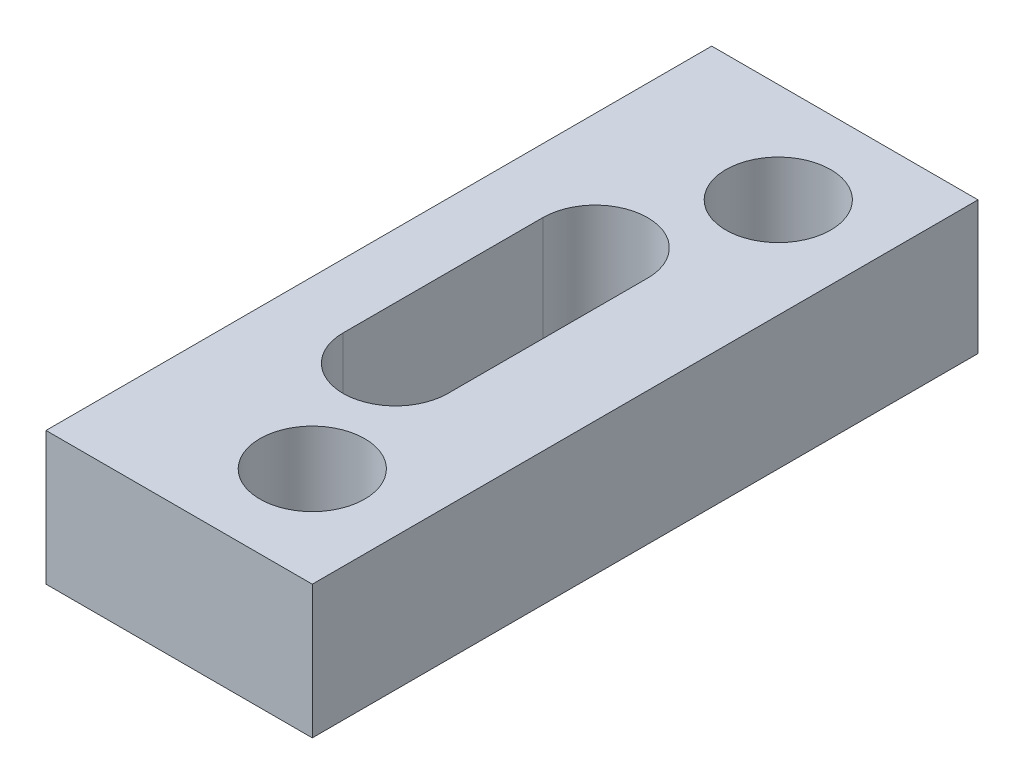
ISO-10303-21;
HEADER;
FILE_DESCRIPTION(('STEP AP214'),'2;1');
FILE_NAME('part.step','',(''),(''),'','','');
FILE_SCHEMA(('AUTOMOTIVE_DESIGN { 1 0 10303 214 1 1 1 1 }'));
ENDSEC;
DATA;
#1=APPLICATION_CONTEXT('core data for automotive mechanical design processes');
#2=APPLICATION_PROTOCOL_DEFINITION('international standard','automotive_design',2000,#1);
#3=PRODUCT_CONTEXT('',#1,'mechanical');
#4=PRODUCT('Part','Part','',(#3));
#5=PRODUCT_RELATED_PRODUCT_CATEGORY('part','',(#4));
#6=PRODUCT_DEFINITION_FORMATION('','',#4);
#7=PRODUCT_DEFINITION_CONTEXT('part definition',#1,'design');
#8=PRODUCT_DEFINITION('design','',#6,#7);
#9=PRODUCT_DEFINITION_SHAPE('','',#8);
#10=(LENGTH_UNIT() NAMED_UNIT(*) SI_UNIT(.MILLI.,.METRE.));
#11=(NAMED_UNIT(*) PLANE_ANGLE_UNIT() SI_UNIT($,.RADIAN.));
#12=(NAMED_UNIT(*) SI_UNIT($,.STERADIAN.) SOLID_ANGLE_UNIT());
#13=UNCERTAINTY_MEASURE_WITH_UNIT(LENGTH_MEASURE(1.E-05),#10,'distance_accuracy_value','');
#14=(GEOMETRIC_REPRESENTATION_CONTEXT(3) GLOBAL_UNCERTAINTY_ASSIGNED_CONTEXT((#13)) GLOBAL_UNIT_ASSIGNED_CONTEXT((#10,
#11,#12)) REPRESENTATION_CONTEXT('',''));
#15=CARTESIAN_POINT('',(0.,0.,0.));
#16=DIRECTION('',(0.,0.,1.));
#17=DIRECTION('',(1.,0.,0.));
#18=AXIS2_PLACEMENT_3D('',#15,#16,#17);
#19=CARTESIAN_POINT('',(8.,-4.,-20.));
#20=DIRECTION('',(0.,0.,-1.));
#21=DIRECTION('',(-1.,0.,0.));
#22=AXIS2_PLACEMENT_3D('',#19,#20,#21);
#23=PLANE('',#22);
#24=DIRECTION('',(-1.,0.,0.));
#25=VECTOR('',#24,1.);
#26=CARTESIAN_POINT('',(8.,0.,-20.));
#27=LINE('',#26,#25);
#28=CARTESIAN_POINT('',(8.,0.,-20.));
#29=VERTEX_POINT('',#28);
#30=CARTESIAN_POINT('',(0.,0.,-20.));
#31=VERTEX_POINT('',#30);
#32=EDGE_CURVE('E143',#29,#31,#27,.T.);
#33=ORIENTED_EDGE('',*,*,#32,.F.);
#34=DIRECTION('',(0.,1.,0.));
#35=VECTOR('',#34,1.);
#36=CARTESIAN_POINT('',(8.,-4.,-20.));
#37=LINE('',#36,#35);
#38=CARTESIAN_POINT('',(8.,-4.,-20.));
#39=VERTEX_POINT('',#38);
#40=EDGE_CURVE('E11',#39,#29,#37,.T.);
#41=ORIENTED_EDGE('',*,*,#40,.F.);
#42=DIRECTION('',(-1.,0.,0.));
#43=VECTOR('',#42,1.);
#44=CARTESIAN_POINT('',(8.,-4.,-20.));
#45=LINE('',#44,#43);
#46=CARTESIAN_POINT('',(0.,-4.,-20.));
#47=VERTEX_POINT('',#46);
#48=EDGE_CURVE('E146',#39,#47,#45,.T.);
#49=ORIENTED_EDGE('',*,*,#48,.T.);
#50=DIRECTION('',(0.,1.,0.));
#51=VECTOR('',#50,1.);
#52=CARTESIAN_POINT('',(0.,-4.,-20.));
#53=LINE('',#52,#51);
#54=EDGE_CURVE('E35',#47,#31,#53,.T.);
#55=ORIENTED_EDGE('',*,*,#54,.T.);
#56=EDGE_LOOP('',(#33,#41,#49,#55));
#57=FACE_BOUND('',#56,.T.);
#58=ADVANCED_FACE('F32',(#57),#23,.T.);
#59=CARTESIAN_POINT('',(8.,-4.,0.));
#60=DIRECTION('',(1.,0.,0.));
#61=DIRECTION('',(0.,0.,-1.));
#62=AXIS2_PLACEMENT_3D('',#59,#60,#61);
#63=PLANE('',#62);
#64=DIRECTION('',(0.,0.,-1.));
#65=VECTOR('',#64,1.);
#66=CARTESIAN_POINT('',(8.,0.,0.));
#67=LINE('',#66,#65);
#68=CARTESIAN_POINT('',(8.,0.,0.));
#69=VERTEX_POINT('',#68);
#70=EDGE_CURVE('E150',#69,#29,#67,.T.);
#71=ORIENTED_EDGE('',*,*,#70,.F.);
#72=DIRECTION('',(0.,1.,0.));
#73=VECTOR('',#72,1.);
#74=CARTESIAN_POINT('',(8.,-4.,0.));
#75=LINE('',#74,#73);
#76=CARTESIAN_POINT('',(8.,-4.,0.));
#77=VERTEX_POINT('',#76);
#78=EDGE_CURVE('E40',#77,#69,#75,.T.);
#79=ORIENTED_EDGE('',*,*,#78,.F.);
#80=DIRECTION('',(0.,0.,-1.));
#81=VECTOR('',#80,1.);
#82=CARTESIAN_POINT('',(8.,-4.,0.));
#83=LINE('',#82,#81);
#84=EDGE_CURVE('E156',#77,#39,#83,.T.);
#85=ORIENTED_EDGE('',*,*,#84,.T.);
#86=ORIENTED_EDGE('',*,*,#40,.T.);
#87=EDGE_LOOP('',(#71,#79,#85,#86));
#88=FACE_BOUND('',#87,.T.);
#89=ADVANCED_FACE('F182',(#88),#63,.T.);
#90=CARTESIAN_POINT('',(0.,-4.,0.));
#91=DIRECTION('',(0.,0.,1.));
#92=DIRECTION('',(1.,0.,0.));
#93=AXIS2_PLACEMENT_3D('',#90,#91,#92);
#94=PLANE('',#93);
#95=DIRECTION('',(1.,0.,0.));
#96=VECTOR('',#95,1.);
#97=CARTESIAN_POINT('',(0.,0.,0.));
#98=LINE('',#97,#96);
#99=CARTESIAN_POINT('',(0.,0.,0.));
#100=VERTEX_POINT('',#99);
#101=EDGE_CURVE('E164',#100,#69,#98,.T.);
#102=ORIENTED_EDGE('',*,*,#101,.F.);
#103=DIRECTION('',(0.,1.,0.));
#104=VECTOR('',#103,1.);
#105=CARTESIAN_POINT('',(0.,-4.,0.));
#106=LINE('',#105,#104);
#107=CARTESIAN_POINT('',(0.,-4.,0.));
#108=VERTEX_POINT('',#107);
#109=EDGE_CURVE('E169',#108,#100,#106,.T.);
#110=ORIENTED_EDGE('',*,*,#109,.F.);
#111=DIRECTION('',(1.,0.,0.));
#112=VECTOR('',#111,1.);
#113=CARTESIAN_POINT('',(0.,-4.,0.));
#114=LINE('',#113,#112);
#115=EDGE_CURVE('E153',#108,#77,#114,.T.);
#116=ORIENTED_EDGE('',*,*,#115,.T.);
#117=ORIENTED_EDGE('',*,*,#78,.T.);
#118=EDGE_LOOP('',(#102,#110,#116,#117));
#119=FACE_BOUND('',#118,.T.);
#120=ADVANCED_FACE('F187',(#119),#94,.T.);
#121=CARTESIAN_POINT('',(0.,-4.,-20.));
#122=DIRECTION('',(-1.,0.,0.));
#123=DIRECTION('',(0.,0.,1.));
#124=AXIS2_PLACEMENT_3D('',#121,#122,#123);
#125=PLANE('',#124);
#126=DIRECTION('',(0.,0.,1.));
#127=VECTOR('',#126,1.);
#128=CARTESIAN_POINT('',(0.,0.,-20.));
#129=LINE('',#128,#127);
#130=EDGE_CURVE('E161',#31,#100,#129,.T.);
#131=ORIENTED_EDGE('',*,*,#130,.F.);
#132=ORIENTED_EDGE('',*,*,#54,.F.);
#133=DIRECTION('',(0.,0.,1.));
#134=VECTOR('',#133,1.);
#135=CARTESIAN_POINT('',(0.,-4.,-20.));
#136=LINE('',#135,#134);
#137=EDGE_CURVE('E149',#47,#108,#136,.T.);
#138=ORIENTED_EDGE('',*,*,#137,.T.);
#139=ORIENTED_EDGE('',*,*,#109,.T.);
#140=EDGE_LOOP('',(#131,#132,#138,#139));
#141=FACE_BOUND('',#140,.T.);
#142=ADVANCED_FACE('F177',(#141),#125,.T.);
#143=CARTESIAN_POINT('',(0.,-4.,0.));
#144=DIRECTION('',(0.,1.,0.));
#145=DIRECTION('',(0.,0.,1.));
#146=AXIS2_PLACEMENT_3D('',#143,#144,#145);
#147=PLANE('',#146);
#148=DIRECTION('',(0.,0.,1.));
#149=VECTOR('',#148,1.);
#150=CARTESIAN_POINT('',(1.925,-4.,-7.));
#151=LINE('',#150,#149);
#152=CARTESIAN_POINT('',(1.925,-4.,-13.));
#153=VERTEX_POINT('',#152);
#154=CARTESIAN_POINT('',(1.925,-4.,-7.));
#155=VERTEX_POINT('',#154);
#156=EDGE_CURVE('E105',#153,#155,#151,.T.);
#157=ORIENTED_EDGE('',*,*,#156,.T.);
#158=CARTESIAN_POINT('',(3.5,-4.,-7.));
#159=DIRECTION('',(0.,1.,0.));
#160=DIRECTION('',(0.,0.,1.));
#161=AXIS2_PLACEMENT_3D('',#158,#159,#160);
#162=CIRCLE('',#161,1.575);
#163=CARTESIAN_POINT('',(5.075,-4.,-7.));
#164=VERTEX_POINT('',#163);
#165=EDGE_CURVE('E99',#155,#164,#162,.T.);
#166=ORIENTED_EDGE('',*,*,#165,.T.);
#167=DIRECTION('',(0.,0.,-1.));
#168=VECTOR('',#167,1.);
#169=CARTESIAN_POINT('',(5.075,-4.,-7.));
#170=LINE('',#169,#168);
#171=CARTESIAN_POINT('',(5.075,-4.,-13.));
#172=VERTEX_POINT('',#171);
#173=EDGE_CURVE('E108',#164,#172,#170,.T.);
#174=ORIENTED_EDGE('',*,*,#173,.T.);
#175=CARTESIAN_POINT('',(3.5,-4.,-13.));
#176=DIRECTION('',(0.,1.,0.));
#177=DIRECTION('',(0.,0.,1.));
#178=AXIS2_PLACEMENT_3D('',#175,#176,#177);
#179=CIRCLE('',#178,1.575);
#180=EDGE_CURVE('E48',#172,#153,#179,.T.);
#181=ORIENTED_EDGE('',*,*,#180,.T.);
#182=EDGE_LOOP('',(#157,#166,#174,#181));
#183=FACE_BOUND('',#182,.T.);
#184=CARTESIAN_POINT('',(5.,-4.,-3.));
#185=DIRECTION('',(0.,1.,0.));
#186=DIRECTION('',(0.,0.,-1.));
#187=AXIS2_PLACEMENT_3D('',#184,#185,#186);
#188=CIRCLE('',#187,1.575);
#189=CARTESIAN_POINT('',(5.,-4.,-4.575));
#190=VERTEX_POINT('',#189);
#191=EDGE_CURVE('E134',#190,#190,#188,.T.);
#192=ORIENTED_EDGE('',*,*,#191,.T.);
#193=EDGE_LOOP('',(#192));
#194=FACE_BOUND('',#193,.T.);
#195=CARTESIAN_POINT('',(5.,-4.,-17.));
#196=DIRECTION('',(0.,1.,0.));
#197=DIRECTION('',(0.,0.,-1.));
#198=AXIS2_PLACEMENT_3D('',#195,#196,#197);
#199=CIRCLE('',#198,1.575);
#200=CARTESIAN_POINT('',(5.,-4.,-18.575));
#201=VERTEX_POINT('',#200);
#202=EDGE_CURVE('E140',#201,#201,#199,.T.);
#203=ORIENTED_EDGE('',*,*,#202,.T.);
#204=EDGE_LOOP('',(#203));
#205=FACE_BOUND('',#204,.T.);
#206=ORIENTED_EDGE('',*,*,#48,.F.);
#207=ORIENTED_EDGE('',*,*,#84,.F.);
#208=ORIENTED_EDGE('',*,*,#115,.F.);
#209=ORIENTED_EDGE('',*,*,#137,.F.);
#210=EDGE_LOOP('',(#206,#207,#208,#209));
#211=FACE_BOUND('',#210,.T.);
#212=ADVANCED_FACE('F112',(#183,#194,#205,#211),#147,.F.);
#213=CARTESIAN_POINT('',(0.,0.,0.));
#214=DIRECTION('',(0.,1.,0.));
#215=DIRECTION('',(0.,0.,1.));
#216=AXIS2_PLACEMENT_3D('',#213,#214,#215);
#217=PLANE('',#216);
#218=CARTESIAN_POINT('',(3.5,0.,-7.));
#219=DIRECTION('',(0.,1.,0.));
#220=DIRECTION('',(0.,0.,1.));
#221=AXIS2_PLACEMENT_3D('',#218,#219,#220);
#222=CIRCLE('',#221,1.575);
#223=CARTESIAN_POINT('',(1.925,0.,-7.));
#224=VERTEX_POINT('',#223);
#225=CARTESIAN_POINT('',(5.075,0.,-7.));
#226=VERTEX_POINT('',#225);
#227=EDGE_CURVE('E56',#224,#226,#222,.T.);
#228=ORIENTED_EDGE('',*,*,#227,.F.);
#229=DIRECTION('',(0.,0.,1.));
#230=VECTOR('',#229,1.);
#231=CARTESIAN_POINT('',(1.925,0.,-7.));
#232=LINE('',#231,#230);
#233=CARTESIAN_POINT('',(1.925,0.,-13.));
#234=VERTEX_POINT('',#233);
#235=EDGE_CURVE('E115',#234,#224,#232,.T.);
#236=ORIENTED_EDGE('',*,*,#235,.F.);
#237=CARTESIAN_POINT('',(3.5,0.,-13.));
#238=DIRECTION('',(0.,1.,0.));
#239=DIRECTION('',(0.,0.,1.));
#240=AXIS2_PLACEMENT_3D('',#237,#238,#239);
#241=CIRCLE('',#240,1.575);
#242=CARTESIAN_POINT('',(5.075,0.,-13.));
#243=VERTEX_POINT('',#242);
#244=EDGE_CURVE('E118',#243,#234,#241,.T.);
#245=ORIENTED_EDGE('',*,*,#244,.F.);
#246=DIRECTION('',(0.,0.,-1.));
#247=VECTOR('',#246,1.);
#248=CARTESIAN_POINT('',(5.075,0.,-7.));
#249=LINE('',#248,#247);
#250=EDGE_CURVE('E124',#226,#243,#249,.T.);
#251=ORIENTED_EDGE('',*,*,#250,.F.);
#252=EDGE_LOOP('',(#228,#236,#245,#251));
#253=FACE_BOUND('',#252,.T.);
#254=CARTESIAN_POINT('',(5.,0.,-3.));
#255=DIRECTION('',(0.,1.,0.));
#256=DIRECTION('',(0.,0.,-1.));
#257=AXIS2_PLACEMENT_3D('',#254,#255,#256);
#258=CIRCLE('',#257,1.575);
#259=CARTESIAN_POINT('',(5.,0.,-4.575));
#260=VERTEX_POINT('',#259);
#261=EDGE_CURVE('E130',#260,#260,#258,.T.);
#262=ORIENTED_EDGE('',*,*,#261,.F.);
#263=EDGE_LOOP('',(#262));
#264=FACE_BOUND('',#263,.T.);
#265=CARTESIAN_POINT('',(5.,0.,-17.));
#266=DIRECTION('',(0.,1.,0.));
#267=DIRECTION('',(0.,0.,-1.));
#268=AXIS2_PLACEMENT_3D('',#265,#266,#267);
#269=CIRCLE('',#268,1.575);
#270=CARTESIAN_POINT('',(5.,0.,-18.575));
#271=VERTEX_POINT('',#270);
#272=EDGE_CURVE('E137',#271,#271,#269,.T.);
#273=ORIENTED_EDGE('',*,*,#272,.F.);
#274=EDGE_LOOP('',(#273));
#275=FACE_BOUND('',#274,.T.);
#276=ORIENTED_EDGE('',*,*,#32,.T.);
#277=ORIENTED_EDGE('',*,*,#130,.T.);
#278=ORIENTED_EDGE('',*,*,#101,.T.);
#279=ORIENTED_EDGE('',*,*,#70,.T.);
#280=EDGE_LOOP('',(#276,#277,#278,#279));
#281=FACE_BOUND('',#280,.T.);
#282=ADVANCED_FACE('F179',(#253,#264,#275,#281),#217,.T.);
#283=CARTESIAN_POINT('',(5.,-4.,-17.));
#284=DIRECTION('',(0.,1.,0.));
#285=DIRECTION('',(0.,0.,1.));
#286=AXIS2_PLACEMENT_3D('',#283,#284,#285);
#287=CYLINDRICAL_SURFACE('',#286,1.575);
#288=ORIENTED_EDGE('',*,*,#202,.F.);
#289=EDGE_LOOP('',(#288));
#290=FACE_BOUND('',#289,.T.);
#291=ORIENTED_EDGE('',*,*,#272,.T.);
#292=EDGE_LOOP('',(#291));
#293=FACE_BOUND('',#292,.T.);
#294=ADVANCED_FACE('F229',(#290,#293),#287,.F.);
#295=CARTESIAN_POINT('',(5.,-4.,-3.));
#296=DIRECTION('',(0.,1.,0.));
#297=DIRECTION('',(0.,0.,1.));
#298=AXIS2_PLACEMENT_3D('',#295,#296,#297);
#299=CYLINDRICAL_SURFACE('',#298,1.575);
#300=ORIENTED_EDGE('',*,*,#191,.F.);
#301=EDGE_LOOP('',(#300));
#302=FACE_BOUND('',#301,.T.);
#303=ORIENTED_EDGE('',*,*,#261,.T.);
#304=EDGE_LOOP('',(#303));
#305=FACE_BOUND('',#304,.T.);
#306=ADVANCED_FACE('F239',(#302,#305),#299,.F.);
#307=CARTESIAN_POINT('',(3.5,-4.,-7.));
#308=DIRECTION('',(0.,1.,0.));
#309=DIRECTION('',(0.,0.,1.));
#310=AXIS2_PLACEMENT_3D('',#307,#308,#309);
#311=CYLINDRICAL_SURFACE('',#310,1.575);
#312=ORIENTED_EDGE('',*,*,#227,.T.);
#313=DIRECTION('',(0.,1.,0.));
#314=VECTOR('',#313,1.);
#315=CARTESIAN_POINT('',(5.075,-4.,-7.));
#316=LINE('',#315,#314);
#317=EDGE_CURVE('E95',#164,#226,#316,.T.);
#318=ORIENTED_EDGE('',*,*,#317,.F.);
#319=ORIENTED_EDGE('',*,*,#165,.F.);
#320=DIRECTION('',(0.,1.,0.));
#321=VECTOR('',#320,1.);
#322=CARTESIAN_POINT('',(1.925,-4.,-7.));
#323=LINE('',#322,#321);
#324=EDGE_CURVE('E128',#155,#224,#323,.T.);
#325=ORIENTED_EDGE('',*,*,#324,.T.);
#326=EDGE_LOOP('',(#312,#318,#319,#325));
#327=FACE_BOUND('',#326,.T.);
#328=ADVANCED_FACE('F97',(#327),#311,.F.);
#329=CARTESIAN_POINT('',(1.925,-4.,-7.));
#330=DIRECTION('',(-1.,0.,0.));
#331=DIRECTION('',(0.,0.,1.));
#332=AXIS2_PLACEMENT_3D('',#329,#330,#331);
#333=PLANE('',#332);
#334=ORIENTED_EDGE('',*,*,#235,.T.);
#335=ORIENTED_EDGE('',*,*,#324,.F.);
#336=ORIENTED_EDGE('',*,*,#156,.F.);
#337=DIRECTION('',(0.,1.,0.));
#338=VECTOR('',#337,1.);
#339=CARTESIAN_POINT('',(1.925,-4.,-13.));
#340=LINE('',#339,#338);
#341=EDGE_CURVE('E131',#153,#234,#340,.T.);
#342=ORIENTED_EDGE('',*,*,#341,.T.);
#343=EDGE_LOOP('',(#334,#335,#336,#342));
#344=FACE_BOUND('',#343,.T.);
#345=ADVANCED_FACE('F258',(#344),#333,.F.);
#346=CARTESIAN_POINT('',(3.5,-4.,-13.));
#347=DIRECTION('',(0.,1.,0.));
#348=DIRECTION('',(0.,0.,1.));
#349=AXIS2_PLACEMENT_3D('',#346,#347,#348);
#350=CYLINDRICAL_SURFACE('',#349,1.575);
#351=ORIENTED_EDGE('',*,*,#244,.T.);
#352=ORIENTED_EDGE('',*,*,#341,.F.);
#353=ORIENTED_EDGE('',*,*,#180,.F.);
#354=DIRECTION('',(0.,1.,0.));
#355=VECTOR('',#354,1.);
#356=CARTESIAN_POINT('',(5.075,-4.,-13.));
#357=LINE('',#356,#355);
#358=EDGE_CURVE('E104',#172,#243,#357,.T.);
#359=ORIENTED_EDGE('',*,*,#358,.T.);
#360=EDGE_LOOP('',(#351,#352,#353,#359));
#361=FACE_BOUND('',#360,.T.);
#362=ADVANCED_FACE('F267',(#361),#350,.F.);
#363=CARTESIAN_POINT('',(5.075,-4.,-7.));
#364=DIRECTION('',(1.,0.,0.));
#365=DIRECTION('',(0.,0.,-1.));
#366=AXIS2_PLACEMENT_3D('',#363,#364,#365);
#367=PLANE('',#366);
#368=ORIENTED_EDGE('',*,*,#250,.T.);
#369=ORIENTED_EDGE('',*,*,#358,.F.);
#370=ORIENTED_EDGE('',*,*,#173,.F.);
#371=ORIENTED_EDGE('',*,*,#317,.T.);
#372=EDGE_LOOP('',(#368,#369,#370,#371));
#373=FACE_BOUND('',#372,.T.);
#374=ADVANCED_FACE('F109',(#373),#367,.F.);
#375=CLOSED_SHELL('',(#58,#89,#120,#142,#212,#282,#294,#306,#328,#345,#362,#374));
#376=MANIFOLD_SOLID_BREP('B2',#375);
#377=ADVANCED_BREP_SHAPE_REPRESENTATION('',(#18,#376),#14);
#378=SHAPE_DEFINITION_REPRESENTATION(#9,#377);
ENDSEC;
END-ISO-10303-21;
